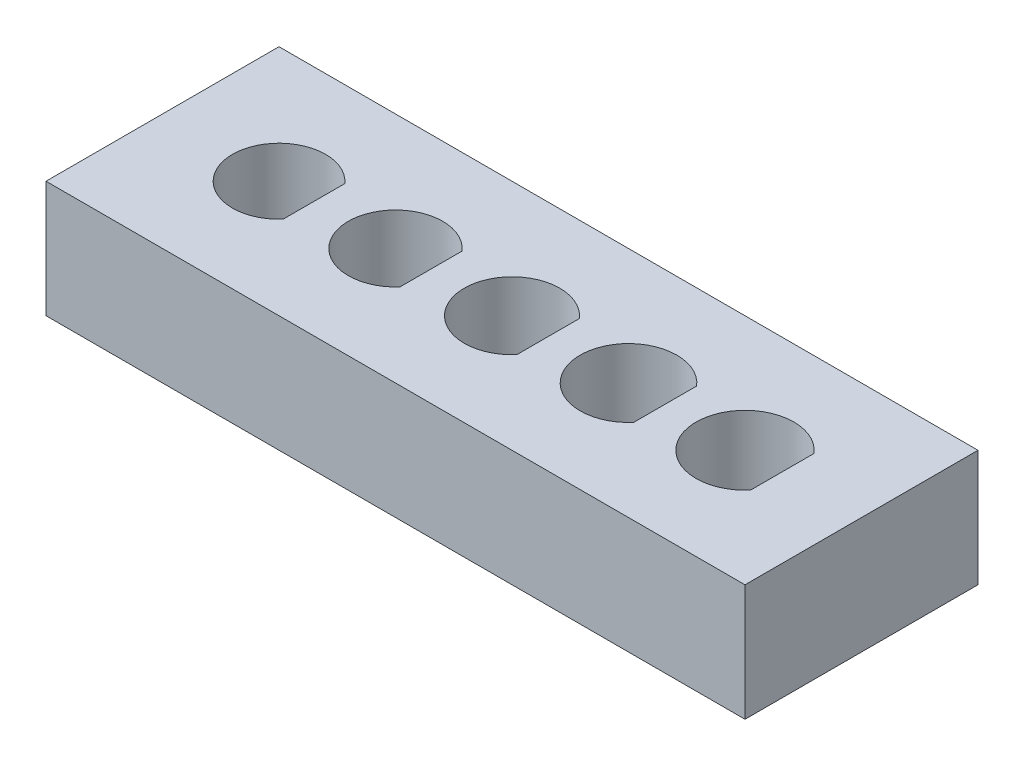
ISO-10303-21;
HEADER;
FILE_DESCRIPTION(('STEP AP214'),'2;1');
FILE_NAME('part.step','',(''),(''),'','','');
FILE_SCHEMA(('AUTOMOTIVE_DESIGN { 1 0 10303 214 1 1 1 1 }'));
ENDSEC;
DATA;
#1=APPLICATION_CONTEXT('core data for automotive mechanical design processes');
#2=APPLICATION_PROTOCOL_DEFINITION('international standard','automotive_design',2000,#1);
#3=PRODUCT_CONTEXT('',#1,'mechanical');
#4=PRODUCT('Part','Part','',(#3));
#5=PRODUCT_RELATED_PRODUCT_CATEGORY('part','',(#4));
#6=PRODUCT_DEFINITION_FORMATION('','',#4);
#7=PRODUCT_DEFINITION_CONTEXT('part definition',#1,'design');
#8=PRODUCT_DEFINITION('design','',#6,#7);
#9=PRODUCT_DEFINITION_SHAPE('','',#8);
#10=(LENGTH_UNIT() NAMED_UNIT(*) SI_UNIT(.MILLI.,.METRE.));
#11=(NAMED_UNIT(*) PLANE_ANGLE_UNIT() SI_UNIT($,.RADIAN.));
#12=(NAMED_UNIT(*) SI_UNIT($,.STERADIAN.) SOLID_ANGLE_UNIT());
#13=UNCERTAINTY_MEASURE_WITH_UNIT(LENGTH_MEASURE(1.E-05),#10,'distance_accuracy_value','');
#14=(GEOMETRIC_REPRESENTATION_CONTEXT(3) GLOBAL_UNCERTAINTY_ASSIGNED_CONTEXT((#13)) GLOBAL_UNIT_ASSIGNED_CONTEXT((#10,
#11,#12)) REPRESENTATION_CONTEXT('',''));
#15=CARTESIAN_POINT('',(0.,0.,0.));
#16=DIRECTION('',(0.,0.,1.));
#17=DIRECTION('',(1.,0.,0.));
#18=AXIS2_PLACEMENT_3D('',#15,#16,#17);
#19=CARTESIAN_POINT('',(15.,-5.,0.));
#20=DIRECTION('',(-1.,0.,0.));
#21=DIRECTION('',(0.,0.,1.));
#22=AXIS2_PLACEMENT_3D('',#19,#20,#21);
#23=PLANE('',#22);
#24=DIRECTION('',(0.,0.,1.));
#25=VECTOR('',#24,1.);
#26=CARTESIAN_POINT('',(15.,0.,0.));
#27=LINE('',#26,#25);
#28=CARTESIAN_POINT('',(15.,0.,-5.));
#29=VERTEX_POINT('',#28);
#30=CARTESIAN_POINT('',(15.,0.,5.));
#31=VERTEX_POINT('',#30);
#32=EDGE_CURVE('E215',#29,#31,#27,.T.);
#33=ORIENTED_EDGE('',*,*,#32,.T.);
#34=DIRECTION('',(0.,1.,0.));
#35=VECTOR('',#34,1.);
#36=CARTESIAN_POINT('',(15.,-5.,5.));
#37=LINE('',#36,#35);
#38=CARTESIAN_POINT('',(15.,-5.,5.));
#39=VERTEX_POINT('',#38);
#40=EDGE_CURVE('E11',#39,#31,#37,.T.);
#41=ORIENTED_EDGE('',*,*,#40,.F.);
#42=DIRECTION('',(0.,0.,1.));
#43=VECTOR('',#42,1.);
#44=CARTESIAN_POINT('',(15.,-5.,0.));
#45=LINE('',#44,#43);
#46=CARTESIAN_POINT('',(15.,-5.,-5.));
#47=VERTEX_POINT('',#46);
#48=EDGE_CURVE('E61',#47,#39,#45,.T.);
#49=ORIENTED_EDGE('',*,*,#48,.F.);
#50=DIRECTION('',(0.,1.,0.));
#51=VECTOR('',#50,1.);
#52=CARTESIAN_POINT('',(15.,-5.,-5.));
#53=LINE('',#52,#51);
#54=EDGE_CURVE('E159',#47,#29,#53,.T.);
#55=ORIENTED_EDGE('',*,*,#54,.T.);
#56=EDGE_LOOP('',(#33,#41,#49,#55));
#57=FACE_BOUND('',#56,.T.);
#58=ADVANCED_FACE('F41',(#57),#23,.F.);
#59=CARTESIAN_POINT('',(0.,-5.,5.));
#60=DIRECTION('',(0.,0.,1.));
#61=DIRECTION('',(1.,0.,0.));
#62=AXIS2_PLACEMENT_3D('',#59,#60,#61);
#63=PLANE('',#62);
#64=DIRECTION('',(1.,0.,0.));
#65=VECTOR('',#64,1.);
#66=CARTESIAN_POINT('',(0.,0.,5.));
#67=LINE('',#66,#65);
#68=CARTESIAN_POINT('',(-15.,0.,5.));
#69=VERTEX_POINT('',#68);
#70=EDGE_CURVE('E223',#69,#31,#67,.T.);
#71=ORIENTED_EDGE('',*,*,#70,.F.);
#72=DIRECTION('',(0.,1.,0.));
#73=VECTOR('',#72,1.);
#74=CARTESIAN_POINT('',(-15.,-5.,5.));
#75=LINE('',#74,#73);
#76=CARTESIAN_POINT('',(-15.,-5.,5.));
#77=VERTEX_POINT('',#76);
#78=EDGE_CURVE('E52',#77,#69,#75,.T.);
#79=ORIENTED_EDGE('',*,*,#78,.F.);
#80=DIRECTION('',(1.,0.,0.));
#81=VECTOR('',#80,1.);
#82=CARTESIAN_POINT('',(0.,-5.,5.));
#83=LINE('',#82,#81);
#84=EDGE_CURVE('E168',#77,#39,#83,.T.);
#85=ORIENTED_EDGE('',*,*,#84,.T.);
#86=ORIENTED_EDGE('',*,*,#40,.T.);
#87=EDGE_LOOP('',(#71,#79,#85,#86));
#88=FACE_BOUND('',#87,.T.);
#89=ADVANCED_FACE('F278',(#88),#63,.T.);
#90=CARTESIAN_POINT('',(-15.,-5.,0.));
#91=DIRECTION('',(-1.,0.,0.));
#92=DIRECTION('',(0.,0.,1.));
#93=AXIS2_PLACEMENT_3D('',#90,#91,#92);
#94=PLANE('',#93);
#95=DIRECTION('',(0.,0.,1.));
#96=VECTOR('',#95,1.);
#97=CARTESIAN_POINT('',(-15.,0.,0.));
#98=LINE('',#97,#96);
#99=CARTESIAN_POINT('',(-15.,0.,-5.));
#100=VERTEX_POINT('',#99);
#101=EDGE_CURVE('E155',#100,#69,#98,.T.);
#102=ORIENTED_EDGE('',*,*,#101,.F.);
#103=DIRECTION('',(0.,1.,0.));
#104=VECTOR('',#103,1.);
#105=CARTESIAN_POINT('',(-15.,-5.,-5.));
#106=LINE('',#105,#104);
#107=CARTESIAN_POINT('',(-15.,-5.,-5.));
#108=VERTEX_POINT('',#107);
#109=EDGE_CURVE('E150',#108,#100,#106,.T.);
#110=ORIENTED_EDGE('',*,*,#109,.F.);
#111=DIRECTION('',(0.,0.,1.));
#112=VECTOR('',#111,1.);
#113=CARTESIAN_POINT('',(-15.,-5.,0.));
#114=LINE('',#113,#112);
#115=EDGE_CURVE('E154',#108,#77,#114,.T.);
#116=ORIENTED_EDGE('',*,*,#115,.T.);
#117=ORIENTED_EDGE('',*,*,#78,.T.);
#118=EDGE_LOOP('',(#102,#110,#116,#117));
#119=FACE_BOUND('',#118,.T.);
#120=ADVANCED_FACE('F152',(#119),#94,.T.);
#121=CARTESIAN_POINT('',(-10.,-5.,0.));
#122=DIRECTION('',(0.,1.,0.));
#123=DIRECTION('',(0.,0.,1.));
#124=AXIS2_PLACEMENT_3D('',#121,#122,#123);
#125=CYLINDRICAL_SURFACE('',#124,2.);
#126=CARTESIAN_POINT('',(-10.,0.,0.));
#127=DIRECTION('',(0.,1.,0.));
#128=DIRECTION('',(0.,0.,1.));
#129=AXIS2_PLACEMENT_3D('',#126,#127,#128);
#130=CIRCLE('',#129,2.);
#131=CARTESIAN_POINT('',(-8.5,0.,-1.3228756555323));
#132=VERTEX_POINT('',#131);
#133=CARTESIAN_POINT('',(-8.5,0.,1.3228756555323));
#134=VERTEX_POINT('',#133);
#135=EDGE_CURVE('E207',#132,#134,#130,.T.);
#136=ORIENTED_EDGE('',*,*,#135,.T.);
#137=DIRECTION('',(0.,1.,0.));
#138=VECTOR('',#137,1.);
#139=CARTESIAN_POINT('',(-8.5,-5.,1.3228756555323));
#140=LINE('',#139,#138);
#141=CARTESIAN_POINT('',(-8.5,-5.,1.3228756555323));
#142=VERTEX_POINT('',#141);
#143=EDGE_CURVE('E232',#142,#134,#140,.T.);
#144=ORIENTED_EDGE('',*,*,#143,.F.);
#145=CARTESIAN_POINT('',(-10.,-5.,0.));
#146=DIRECTION('',(0.,1.,0.));
#147=DIRECTION('',(0.,0.,1.));
#148=AXIS2_PLACEMENT_3D('',#145,#146,#147);
#149=CIRCLE('',#148,2.);
#150=CARTESIAN_POINT('',(-8.5,-5.,-1.3228756555323));
#151=VERTEX_POINT('',#150);
#152=EDGE_CURVE('E346',#151,#142,#149,.T.);
#153=ORIENTED_EDGE('',*,*,#152,.F.);
#154=DIRECTION('',(0.,1.,0.));
#155=VECTOR('',#154,1.);
#156=CARTESIAN_POINT('',(-8.5,-5.,-1.3228756555323));
#157=LINE('',#156,#155);
#158=EDGE_CURVE('E235',#151,#132,#157,.T.);
#159=ORIENTED_EDGE('',*,*,#158,.T.);
#160=EDGE_LOOP('',(#136,#144,#153,#159));
#161=FACE_BOUND('',#160,.T.);
#162=ADVANCED_FACE('F292',(#161),#125,.F.);
#163=CARTESIAN_POINT('',(-5.,-5.,0.));
#164=DIRECTION('',(0.,1.,0.));
#165=DIRECTION('',(0.,0.,1.));
#166=AXIS2_PLACEMENT_3D('',#163,#164,#165);
#167=CYLINDRICAL_SURFACE('',#166,2.025);
#168=CARTESIAN_POINT('',(-5.,0.,0.));
#169=DIRECTION('',(0.,1.,0.));
#170=DIRECTION('',(0.,0.,1.));
#171=AXIS2_PLACEMENT_3D('',#168,#169,#170);
#172=CIRCLE('',#171,2.025);
#173=CARTESIAN_POINT('',(-3.475,0.,-1.33229125944742));
#174=VERTEX_POINT('',#173);
#175=CARTESIAN_POINT('',(-3.475,0.,1.33229125944742));
#176=VERTEX_POINT('',#175);
#177=EDGE_CURVE('E199',#174,#176,#172,.T.);
#178=ORIENTED_EDGE('',*,*,#177,.T.);
#179=DIRECTION('',(0.,1.,0.));
#180=VECTOR('',#179,1.);
#181=CARTESIAN_POINT('',(-3.475,-5.,1.33229125944742));
#182=LINE('',#181,#180);
#183=CARTESIAN_POINT('',(-3.475,-5.,1.33229125944742));
#184=VERTEX_POINT('',#183);
#185=EDGE_CURVE('E238',#184,#176,#182,.T.);
#186=ORIENTED_EDGE('',*,*,#185,.F.);
#187=CARTESIAN_POINT('',(-5.,-5.,0.));
#188=DIRECTION('',(0.,1.,0.));
#189=DIRECTION('',(0.,0.,1.));
#190=AXIS2_PLACEMENT_3D('',#187,#188,#189);
#191=CIRCLE('',#190,2.025);
#192=CARTESIAN_POINT('',(-3.475,-5.,-1.33229125944742));
#193=VERTEX_POINT('',#192);
#194=EDGE_CURVE('E339',#193,#184,#191,.T.);
#195=ORIENTED_EDGE('',*,*,#194,.F.);
#196=DIRECTION('',(0.,1.,0.));
#197=VECTOR('',#196,1.);
#198=CARTESIAN_POINT('',(-3.475,-5.,-1.33229125944742));
#199=LINE('',#198,#197);
#200=EDGE_CURVE('E241',#193,#174,#199,.T.);
#201=ORIENTED_EDGE('',*,*,#200,.T.);
#202=EDGE_LOOP('',(#178,#186,#195,#201));
#203=FACE_BOUND('',#202,.T.);
#204=ADVANCED_FACE('F295',(#203),#167,.F.);
#205=CARTESIAN_POINT('',(0.,-5.,0.));
#206=DIRECTION('',(0.,1.,0.));
#207=DIRECTION('',(0.,0.,1.));
#208=AXIS2_PLACEMENT_3D('',#205,#206,#207);
#209=CYLINDRICAL_SURFACE('',#208,2.05);
#210=CARTESIAN_POINT('',(0.,0.,0.));
#211=DIRECTION('',(0.,1.,0.));
#212=DIRECTION('',(0.,0.,1.));
#213=AXIS2_PLACEMENT_3D('',#210,#211,#212);
#214=CIRCLE('',#213,2.05);
#215=CARTESIAN_POINT('',(1.55,0.,-1.34164078649987));
#216=VERTEX_POINT('',#215);
#217=CARTESIAN_POINT('',(1.55,0.,1.34164078649987));
#218=VERTEX_POINT('',#217);
#219=EDGE_CURVE('E191',#216,#218,#214,.T.);
#220=ORIENTED_EDGE('',*,*,#219,.T.);
#221=DIRECTION('',(0.,1.,0.));
#222=VECTOR('',#221,1.);
#223=CARTESIAN_POINT('',(1.55,-5.,1.34164078649987));
#224=LINE('',#223,#222);
#225=CARTESIAN_POINT('',(1.55,-5.,1.34164078649987));
#226=VERTEX_POINT('',#225);
#227=EDGE_CURVE('E244',#226,#218,#224,.T.);
#228=ORIENTED_EDGE('',*,*,#227,.F.);
#229=CARTESIAN_POINT('',(0.,-5.,0.));
#230=DIRECTION('',(0.,1.,0.));
#231=DIRECTION('',(0.,0.,1.));
#232=AXIS2_PLACEMENT_3D('',#229,#230,#231);
#233=CIRCLE('',#232,2.05);
#234=CARTESIAN_POINT('',(1.55,-5.,-1.34164078649987));
#235=VERTEX_POINT('',#234);
#236=EDGE_CURVE('E325',#235,#226,#233,.T.);
#237=ORIENTED_EDGE('',*,*,#236,.F.);
#238=DIRECTION('',(0.,1.,0.));
#239=VECTOR('',#238,1.);
#240=CARTESIAN_POINT('',(1.55,-5.,-1.34164078649987));
#241=LINE('',#240,#239);
#242=EDGE_CURVE('E247',#235,#216,#241,.T.);
#243=ORIENTED_EDGE('',*,*,#242,.T.);
#244=EDGE_LOOP('',(#220,#228,#237,#243));
#245=FACE_BOUND('',#244,.T.);
#246=ADVANCED_FACE('F302',(#245),#209,.F.);
#247=CARTESIAN_POINT('',(5.,-5.,0.));
#248=DIRECTION('',(0.,1.,0.));
#249=DIRECTION('',(0.,0.,1.));
#250=AXIS2_PLACEMENT_3D('',#247,#248,#249);
#251=CYLINDRICAL_SURFACE('',#250,2.075);
#252=CARTESIAN_POINT('',(5.,0.,0.));
#253=DIRECTION('',(0.,1.,0.));
#254=DIRECTION('',(0.,0.,1.));
#255=AXIS2_PLACEMENT_3D('',#252,#253,#254);
#256=CIRCLE('',#255,2.075);
#257=CARTESIAN_POINT('',(6.575,0.,-1.35092560861063));
#258=VERTEX_POINT('',#257);
#259=CARTESIAN_POINT('',(6.575,0.,1.35092560861063));
#260=VERTEX_POINT('',#259);
#261=EDGE_CURVE('E183',#258,#260,#256,.T.);
#262=ORIENTED_EDGE('',*,*,#261,.T.);
#263=DIRECTION('',(0.,1.,0.));
#264=VECTOR('',#263,1.);
#265=CARTESIAN_POINT('',(6.575,-5.,1.35092560861063));
#266=LINE('',#265,#264);
#267=CARTESIAN_POINT('',(6.575,-5.,1.35092560861063));
#268=VERTEX_POINT('',#267);
#269=EDGE_CURVE('E250',#268,#260,#266,.T.);
#270=ORIENTED_EDGE('',*,*,#269,.F.);
#271=CARTESIAN_POINT('',(5.,-5.,0.));
#272=DIRECTION('',(0.,1.,0.));
#273=DIRECTION('',(0.,0.,1.));
#274=AXIS2_PLACEMENT_3D('',#271,#272,#273);
#275=CIRCLE('',#274,2.075);
#276=CARTESIAN_POINT('',(6.575,-5.,-1.35092560861063));
#277=VERTEX_POINT('',#276);
#278=EDGE_CURVE('E326',#277,#268,#275,.T.);
#279=ORIENTED_EDGE('',*,*,#278,.F.);
#280=DIRECTION('',(0.,1.,0.));
#281=VECTOR('',#280,1.);
#282=CARTESIAN_POINT('',(6.575,-5.,-1.35092560861063));
#283=LINE('',#282,#281);
#284=EDGE_CURVE('E253',#277,#258,#283,.T.);
#285=ORIENTED_EDGE('',*,*,#284,.T.);
#286=EDGE_LOOP('',(#262,#270,#279,#285));
#287=FACE_BOUND('',#286,.T.);
#288=ADVANCED_FACE('F308',(#287),#251,.F.);
#289=CARTESIAN_POINT('',(10.,-5.,0.));
#290=DIRECTION('',(0.,1.,0.));
#291=DIRECTION('',(0.,0.,1.));
#292=AXIS2_PLACEMENT_3D('',#289,#290,#291);
#293=CYLINDRICAL_SURFACE('',#292,2.1);
#294=CARTESIAN_POINT('',(10.,0.,0.));
#295=DIRECTION('',(0.,1.,0.));
#296=DIRECTION('',(0.,0.,1.));
#297=AXIS2_PLACEMENT_3D('',#294,#295,#296);
#298=CIRCLE('',#297,2.1);
#299=CARTESIAN_POINT('',(11.6,0.,-1.36014705087355));
#300=VERTEX_POINT('',#299);
#301=CARTESIAN_POINT('',(11.6,0.,1.36014705087355));
#302=VERTEX_POINT('',#301);
#303=EDGE_CURVE('E175',#300,#302,#298,.T.);
#304=ORIENTED_EDGE('',*,*,#303,.T.);
#305=DIRECTION('',(0.,1.,0.));
#306=VECTOR('',#305,1.);
#307=CARTESIAN_POINT('',(11.6,-5.,1.36014705087355));
#308=LINE('',#307,#306);
#309=CARTESIAN_POINT('',(11.6,-5.,1.36014705087355));
#310=VERTEX_POINT('',#309);
#311=EDGE_CURVE('E255',#310,#302,#308,.T.);
#312=ORIENTED_EDGE('',*,*,#311,.F.);
#313=CARTESIAN_POINT('',(10.,-5.,0.));
#314=DIRECTION('',(0.,1.,0.));
#315=DIRECTION('',(0.,0.,1.));
#316=AXIS2_PLACEMENT_3D('',#313,#314,#315);
#317=CIRCLE('',#316,2.1);
#318=CARTESIAN_POINT('',(11.6,-5.,-1.36014705087355));
#319=VERTEX_POINT('',#318);
#320=EDGE_CURVE('E226',#319,#310,#317,.T.);
#321=ORIENTED_EDGE('',*,*,#320,.F.);
#322=DIRECTION('',(0.,1.,0.));
#323=VECTOR('',#322,1.);
#324=CARTESIAN_POINT('',(11.6,-5.,-1.36014705087355));
#325=LINE('',#324,#323);
#326=EDGE_CURVE('E45',#319,#300,#325,.T.);
#327=ORIENTED_EDGE('',*,*,#326,.T.);
#328=EDGE_LOOP('',(#304,#312,#321,#327));
#329=FACE_BOUND('',#328,.T.);
#330=ADVANCED_FACE('F43',(#329),#293,.F.);
#331=CARTESIAN_POINT('',(-8.5,-5.,0.));
#332=DIRECTION('',(-1.,0.,0.));
#333=DIRECTION('',(0.,0.,1.));
#334=AXIS2_PLACEMENT_3D('',#331,#332,#333);
#335=PLANE('',#334);
#336=DIRECTION('',(0.,0.,1.));
#337=VECTOR('',#336,1.);
#338=CARTESIAN_POINT('',(-8.5,0.,0.));
#339=LINE('',#338,#337);
#340=EDGE_CURVE('E211',#132,#134,#339,.T.);
#341=ORIENTED_EDGE('',*,*,#340,.F.);
#342=ORIENTED_EDGE('',*,*,#158,.F.);
#343=DIRECTION('',(0.,0.,1.));
#344=VECTOR('',#343,1.);
#345=CARTESIAN_POINT('',(-8.5,-5.,0.));
#346=LINE('',#345,#344);
#347=EDGE_CURVE('E349',#151,#142,#346,.T.);
#348=ORIENTED_EDGE('',*,*,#347,.T.);
#349=ORIENTED_EDGE('',*,*,#143,.T.);
#350=EDGE_LOOP('',(#341,#342,#348,#349));
#351=FACE_BOUND('',#350,.T.);
#352=ADVANCED_FACE('F287',(#351),#335,.T.);
#353=CARTESIAN_POINT('',(-3.475,-5.,0.));
#354=DIRECTION('',(-1.,0.,0.));
#355=DIRECTION('',(0.,0.,1.));
#356=AXIS2_PLACEMENT_3D('',#353,#354,#355);
#357=PLANE('',#356);
#358=DIRECTION('',(0.,0.,1.));
#359=VECTOR('',#358,1.);
#360=CARTESIAN_POINT('',(-3.475,0.,0.));
#361=LINE('',#360,#359);
#362=EDGE_CURVE('E203',#174,#176,#361,.T.);
#363=ORIENTED_EDGE('',*,*,#362,.F.);
#364=ORIENTED_EDGE('',*,*,#200,.F.);
#365=DIRECTION('',(0.,0.,1.));
#366=VECTOR('',#365,1.);
#367=CARTESIAN_POINT('',(-3.475,-5.,0.));
#368=LINE('',#367,#366);
#369=EDGE_CURVE('E342',#193,#184,#368,.T.);
#370=ORIENTED_EDGE('',*,*,#369,.T.);
#371=ORIENTED_EDGE('',*,*,#185,.T.);
#372=EDGE_LOOP('',(#363,#364,#370,#371));
#373=FACE_BOUND('',#372,.T.);
#374=ADVANCED_FACE('F290',(#373),#357,.T.);
#375=CARTESIAN_POINT('',(1.55,-5.,0.));
#376=DIRECTION('',(-1.,0.,0.));
#377=DIRECTION('',(0.,0.,1.));
#378=AXIS2_PLACEMENT_3D('',#375,#376,#377);
#379=PLANE('',#378);
#380=DIRECTION('',(0.,0.,1.));
#381=VECTOR('',#380,1.);
#382=CARTESIAN_POINT('',(1.55,0.,0.));
#383=LINE('',#382,#381);
#384=EDGE_CURVE('E195',#216,#218,#383,.T.);
#385=ORIENTED_EDGE('',*,*,#384,.F.);
#386=ORIENTED_EDGE('',*,*,#242,.F.);
#387=DIRECTION('',(0.,0.,1.));
#388=VECTOR('',#387,1.);
#389=CARTESIAN_POINT('',(1.55,-5.,0.));
#390=LINE('',#389,#388);
#391=EDGE_CURVE('E330',#235,#226,#390,.T.);
#392=ORIENTED_EDGE('',*,*,#391,.T.);
#393=ORIENTED_EDGE('',*,*,#227,.T.);
#394=EDGE_LOOP('',(#385,#386,#392,#393));
#395=FACE_BOUND('',#394,.T.);
#396=ADVANCED_FACE('F273',(#395),#379,.T.);
#397=CARTESIAN_POINT('',(6.575,-5.,0.));
#398=DIRECTION('',(-1.,0.,0.));
#399=DIRECTION('',(0.,0.,1.));
#400=AXIS2_PLACEMENT_3D('',#397,#398,#399);
#401=PLANE('',#400);
#402=DIRECTION('',(0.,0.,1.));
#403=VECTOR('',#402,1.);
#404=CARTESIAN_POINT('',(6.575,0.,0.));
#405=LINE('',#404,#403);
#406=EDGE_CURVE('E187',#258,#260,#405,.T.);
#407=ORIENTED_EDGE('',*,*,#406,.F.);
#408=ORIENTED_EDGE('',*,*,#284,.F.);
#409=DIRECTION('',(0.,0.,1.));
#410=VECTOR('',#409,1.);
#411=CARTESIAN_POINT('',(6.575,-5.,0.));
#412=LINE('',#411,#410);
#413=EDGE_CURVE('E322',#277,#268,#412,.T.);
#414=ORIENTED_EDGE('',*,*,#413,.T.);
#415=ORIENTED_EDGE('',*,*,#269,.T.);
#416=EDGE_LOOP('',(#407,#408,#414,#415));
#417=FACE_BOUND('',#416,.T.);
#418=ADVANCED_FACE('F267',(#417),#401,.T.);
#419=CARTESIAN_POINT('',(11.6,-5.,0.));
#420=DIRECTION('',(-1.,0.,0.));
#421=DIRECTION('',(0.,0.,1.));
#422=AXIS2_PLACEMENT_3D('',#419,#420,#421);
#423=PLANE('',#422);
#424=DIRECTION('',(0.,0.,1.));
#425=VECTOR('',#424,1.);
#426=CARTESIAN_POINT('',(11.6,0.,0.));
#427=LINE('',#426,#425);
#428=EDGE_CURVE('E179',#300,#302,#427,.T.);
#429=ORIENTED_EDGE('',*,*,#428,.F.);
#430=ORIENTED_EDGE('',*,*,#326,.F.);
#431=DIRECTION('',(0.,0.,1.));
#432=VECTOR('',#431,1.);
#433=CARTESIAN_POINT('',(11.6,-5.,0.));
#434=LINE('',#433,#432);
#435=EDGE_CURVE('E332',#319,#310,#434,.T.);
#436=ORIENTED_EDGE('',*,*,#435,.T.);
#437=ORIENTED_EDGE('',*,*,#311,.T.);
#438=EDGE_LOOP('',(#429,#430,#436,#437));
#439=FACE_BOUND('',#438,.T.);
#440=ADVANCED_FACE('F265',(#439),#423,.T.);
#441=CARTESIAN_POINT('',(0.,-5.,-5.));
#442=DIRECTION('',(0.,0.,1.));
#443=DIRECTION('',(1.,0.,0.));
#444=AXIS2_PLACEMENT_3D('',#441,#442,#443);
#445=PLANE('',#444);
#446=DIRECTION('',(1.,0.,0.));
#447=VECTOR('',#446,1.);
#448=CARTESIAN_POINT('',(0.,0.,-5.));
#449=LINE('',#448,#447);
#450=EDGE_CURVE('E218',#100,#29,#449,.T.);
#451=ORIENTED_EDGE('',*,*,#450,.T.);
#452=ORIENTED_EDGE('',*,*,#54,.F.);
#453=DIRECTION('',(1.,0.,0.));
#454=VECTOR('',#453,1.);
#455=CARTESIAN_POINT('',(0.,-5.,-5.));
#456=LINE('',#455,#454);
#457=EDGE_CURVE('E162',#108,#47,#456,.T.);
#458=ORIENTED_EDGE('',*,*,#457,.F.);
#459=ORIENTED_EDGE('',*,*,#109,.T.);
#460=EDGE_LOOP('',(#451,#452,#458,#459));
#461=FACE_BOUND('',#460,.T.);
#462=ADVANCED_FACE('F163',(#461),#445,.F.);
#463=CARTESIAN_POINT('',(0.,-5.,0.));
#464=DIRECTION('',(0.,1.,0.));
#465=DIRECTION('',(0.,0.,1.));
#466=AXIS2_PLACEMENT_3D('',#463,#464,#465);
#467=PLANE('',#466);
#468=ORIENTED_EDGE('',*,*,#320,.T.);
#469=ORIENTED_EDGE('',*,*,#435,.F.);
#470=EDGE_LOOP('',(#468,#469));
#471=FACE_BOUND('',#470,.T.);
#472=ORIENTED_EDGE('',*,*,#278,.T.);
#473=ORIENTED_EDGE('',*,*,#413,.F.);
#474=EDGE_LOOP('',(#472,#473));
#475=FACE_BOUND('',#474,.T.);
#476=ORIENTED_EDGE('',*,*,#236,.T.);
#477=ORIENTED_EDGE('',*,*,#391,.F.);
#478=EDGE_LOOP('',(#476,#477));
#479=FACE_BOUND('',#478,.T.);
#480=ORIENTED_EDGE('',*,*,#194,.T.);
#481=ORIENTED_EDGE('',*,*,#369,.F.);
#482=EDGE_LOOP('',(#480,#481));
#483=FACE_BOUND('',#482,.T.);
#484=ORIENTED_EDGE('',*,*,#152,.T.);
#485=ORIENTED_EDGE('',*,*,#347,.F.);
#486=EDGE_LOOP('',(#484,#485));
#487=FACE_BOUND('',#486,.T.);
#488=ORIENTED_EDGE('',*,*,#48,.T.);
#489=ORIENTED_EDGE('',*,*,#84,.F.);
#490=ORIENTED_EDGE('',*,*,#115,.F.);
#491=ORIENTED_EDGE('',*,*,#457,.T.);
#492=EDGE_LOOP('',(#488,#489,#490,#491));
#493=FACE_BOUND('',#492,.T.);
#494=ADVANCED_FACE('F167',(#471,#475,#479,#483,#487,#493),#467,.F.);
#495=CARTESIAN_POINT('',(0.,0.,0.));
#496=DIRECTION('',(0.,1.,0.));
#497=DIRECTION('',(0.,0.,1.));
#498=AXIS2_PLACEMENT_3D('',#495,#496,#497);
#499=PLANE('',#498);
#500=ORIENTED_EDGE('',*,*,#303,.F.);
#501=ORIENTED_EDGE('',*,*,#428,.T.);
#502=EDGE_LOOP('',(#500,#501));
#503=FACE_BOUND('',#502,.T.);
#504=ORIENTED_EDGE('',*,*,#261,.F.);
#505=ORIENTED_EDGE('',*,*,#406,.T.);
#506=EDGE_LOOP('',(#504,#505));
#507=FACE_BOUND('',#506,.T.);
#508=ORIENTED_EDGE('',*,*,#219,.F.);
#509=ORIENTED_EDGE('',*,*,#384,.T.);
#510=EDGE_LOOP('',(#508,#509));
#511=FACE_BOUND('',#510,.T.);
#512=ORIENTED_EDGE('',*,*,#177,.F.);
#513=ORIENTED_EDGE('',*,*,#362,.T.);
#514=EDGE_LOOP('',(#512,#513));
#515=FACE_BOUND('',#514,.T.);
#516=ORIENTED_EDGE('',*,*,#135,.F.);
#517=ORIENTED_EDGE('',*,*,#340,.T.);
#518=EDGE_LOOP('',(#516,#517));
#519=FACE_BOUND('',#518,.T.);
#520=ORIENTED_EDGE('',*,*,#32,.F.);
#521=ORIENTED_EDGE('',*,*,#450,.F.);
#522=ORIENTED_EDGE('',*,*,#101,.T.);
#523=ORIENTED_EDGE('',*,*,#70,.T.);
#524=EDGE_LOOP('',(#520,#521,#522,#523));
#525=FACE_BOUND('',#524,.T.);
#526=ADVANCED_FACE('F263',(#503,#507,#511,#515,#519,#525),#499,.T.);
#527=CLOSED_SHELL('',(#58,#89,#120,#162,#204,#246,#288,#330,#352,#374,#396,#418,#440,#462,#494,#526));
#528=MANIFOLD_SOLID_BREP('B2',#527);
#529=ADVANCED_BREP_SHAPE_REPRESENTATION('',(#18,#528),#14);
#530=SHAPE_DEFINITION_REPRESENTATION(#9,#529);
ENDSEC;
END-ISO-10303-21;
